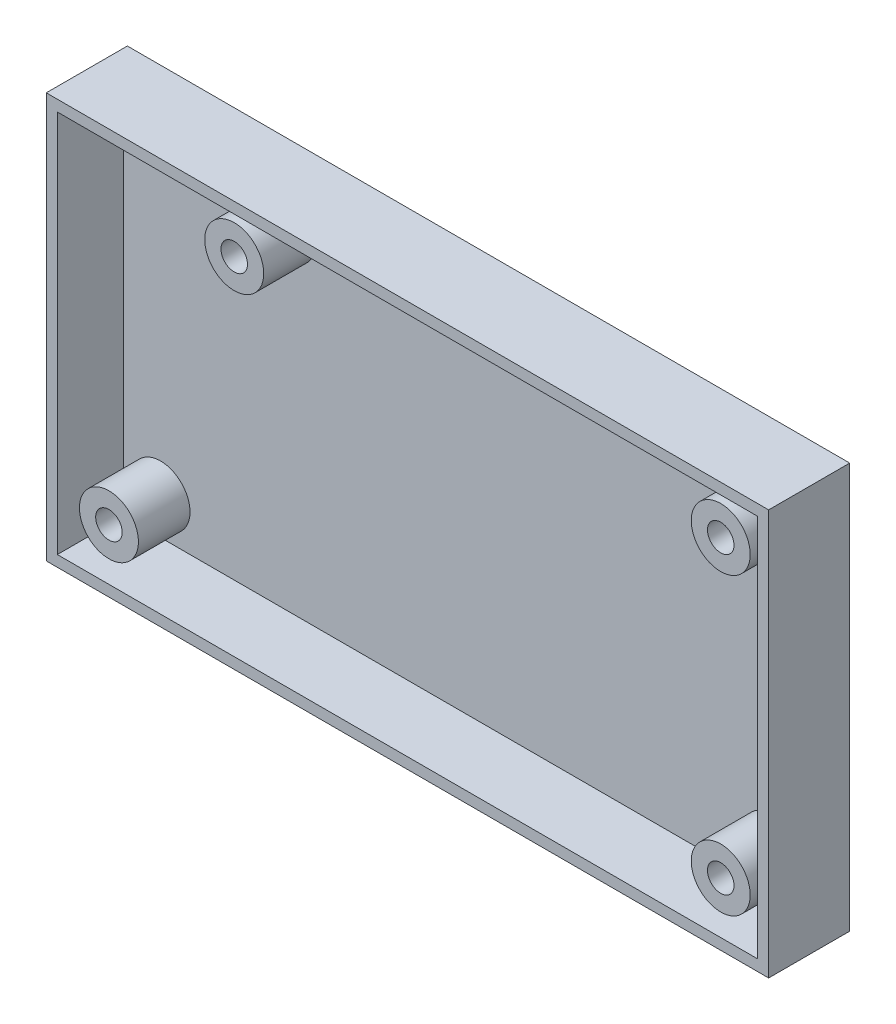
ISO-10303-21;
HEADER;
FILE_DESCRIPTION(('STEP AP214'),'2;1');
FILE_NAME('part.step','',(''),(''),'','','');
FILE_SCHEMA(('AUTOMOTIVE_DESIGN { 1 0 10303 214 1 1 1 1 }'));
ENDSEC;
DATA;
#1=APPLICATION_CONTEXT('core data for automotive mechanical design processes');
#2=APPLICATION_PROTOCOL_DEFINITION('international standard','automotive_design',2000,#1);
#3=PRODUCT_CONTEXT('',#1,'mechanical');
#4=PRODUCT('Part','Part','',(#3));
#5=PRODUCT_RELATED_PRODUCT_CATEGORY('part','',(#4));
#6=PRODUCT_DEFINITION_FORMATION('','',#4);
#7=PRODUCT_DEFINITION_CONTEXT('part definition',#1,'design');
#8=PRODUCT_DEFINITION('design','',#6,#7);
#9=PRODUCT_DEFINITION_SHAPE('','',#8);
#10=(LENGTH_UNIT() NAMED_UNIT(*) SI_UNIT(.MILLI.,.METRE.));
#11=(NAMED_UNIT(*) PLANE_ANGLE_UNIT() SI_UNIT($,.RADIAN.));
#12=(NAMED_UNIT(*) SI_UNIT($,.STERADIAN.) SOLID_ANGLE_UNIT());
#13=UNCERTAINTY_MEASURE_WITH_UNIT(LENGTH_MEASURE(1.E-05),#10,'distance_accuracy_value','');
#14=(GEOMETRIC_REPRESENTATION_CONTEXT(3) GLOBAL_UNCERTAINTY_ASSIGNED_CONTEXT((#13)) GLOBAL_UNIT_ASSIGNED_CONTEXT((#10,
#11,#12)) REPRESENTATION_CONTEXT('',''));
#15=CARTESIAN_POINT('',(0.,0.,0.));
#16=DIRECTION('',(0.,0.,1.));
#17=DIRECTION('',(1.,0.,0.));
#18=AXIS2_PLACEMENT_3D('',#15,#16,#17);
#19=CARTESIAN_POINT('',(0.,0.,2.));
#20=DIRECTION('',(1.,0.,0.));
#21=DIRECTION('',(0.,1.,0.));
#22=AXIS2_PLACEMENT_3D('',#19,#20,#21);
#23=PLANE('',#22);
#24=DIRECTION('',(0.,-1.,0.));
#25=VECTOR('',#24,1.);
#26=CARTESIAN_POINT('',(0.,0.,0.));
#27=LINE('',#26,#25);
#28=CARTESIAN_POINT('',(0.,0.,0.));
#29=VERTEX_POINT('',#28);
#30=CARTESIAN_POINT('',(0.,-55.,0.));
#31=VERTEX_POINT('',#30);
#32=EDGE_CURVE('E173',#29,#31,#27,.T.);
#33=ORIENTED_EDGE('',*,*,#32,.T.);
#34=DIRECTION('',(0.,0.,-1.));
#35=VECTOR('',#34,1.);
#36=CARTESIAN_POINT('',(0.,-55.,2.));
#37=LINE('',#36,#35);
#38=CARTESIAN_POINT('',(0.,-55.,11.));
#39=VERTEX_POINT('',#38);
#40=EDGE_CURVE('E198',#39,#31,#37,.T.);
#41=ORIENTED_EDGE('',*,*,#40,.F.);
#42=DIRECTION('',(0.,-1.,0.));
#43=VECTOR('',#42,1.);
#44=CARTESIAN_POINT('',(0.,0.,11.));
#45=LINE('',#44,#43);
#46=CARTESIAN_POINT('',(0.,0.,11.));
#47=VERTEX_POINT('',#46);
#48=EDGE_CURVE('E169',#47,#39,#45,.T.);
#49=ORIENTED_EDGE('',*,*,#48,.F.);
#50=DIRECTION('',(0.,0.,-1.));
#51=VECTOR('',#50,1.);
#52=CARTESIAN_POINT('',(0.,0.,2.));
#53=LINE('',#52,#51);
#54=EDGE_CURVE('E186',#47,#29,#53,.T.);
#55=ORIENTED_EDGE('',*,*,#54,.T.);
#56=EDGE_LOOP('',(#33,#41,#49,#55));
#57=FACE_BOUND('',#56,.T.);
#58=ADVANCED_FACE('F43',(#57),#23,.F.);
#59=CARTESIAN_POINT('',(0.,-55.,2.));
#60=DIRECTION('',(0.,1.,0.));
#61=DIRECTION('',(0.,0.,1.));
#62=AXIS2_PLACEMENT_3D('',#59,#60,#61);
#63=PLANE('',#62);
#64=DIRECTION('',(1.,0.,0.));
#65=VECTOR('',#64,1.);
#66=CARTESIAN_POINT('',(0.,-55.,0.));
#67=LINE('',#66,#65);
#68=CARTESIAN_POINT('',(98.,-55.,0.));
#69=VERTEX_POINT('',#68);
#70=EDGE_CURVE('E177',#31,#69,#67,.T.);
#71=ORIENTED_EDGE('',*,*,#70,.T.);
#72=DIRECTION('',(0.,0.,-1.));
#73=VECTOR('',#72,1.);
#74=CARTESIAN_POINT('',(98.,-55.,2.));
#75=LINE('',#74,#73);
#76=CARTESIAN_POINT('',(98.,-55.,11.));
#77=VERTEX_POINT('',#76);
#78=EDGE_CURVE('E194',#77,#69,#75,.T.);
#79=ORIENTED_EDGE('',*,*,#78,.F.);
#80=DIRECTION('',(1.,0.,0.));
#81=VECTOR('',#80,1.);
#82=CARTESIAN_POINT('',(0.,-55.,11.));
#83=LINE('',#82,#81);
#84=EDGE_CURVE('E124',#39,#77,#83,.T.);
#85=ORIENTED_EDGE('',*,*,#84,.F.);
#86=ORIENTED_EDGE('',*,*,#40,.T.);
#87=EDGE_LOOP('',(#71,#79,#85,#86));
#88=FACE_BOUND('',#87,.T.);
#89=ADVANCED_FACE('F243',(#88),#63,.F.);
#90=CARTESIAN_POINT('',(98.,0.,2.));
#91=DIRECTION('',(-1.,0.,0.));
#92=DIRECTION('',(0.,0.,1.));
#93=AXIS2_PLACEMENT_3D('',#90,#91,#92);
#94=PLANE('',#93);
#95=DIRECTION('',(0.,1.,0.));
#96=VECTOR('',#95,1.);
#97=CARTESIAN_POINT('',(98.,0.,0.));
#98=LINE('',#97,#96);
#99=CARTESIAN_POINT('',(98.,0.,0.));
#100=VERTEX_POINT('',#99);
#101=EDGE_CURVE('E180',#69,#100,#98,.T.);
#102=ORIENTED_EDGE('',*,*,#101,.T.);
#103=DIRECTION('',(0.,0.,-1.));
#104=VECTOR('',#103,1.);
#105=CARTESIAN_POINT('',(98.,0.,2.));
#106=LINE('',#105,#104);
#107=CARTESIAN_POINT('',(98.,0.,11.));
#108=VERTEX_POINT('',#107);
#109=EDGE_CURVE('E190',#108,#100,#106,.T.);
#110=ORIENTED_EDGE('',*,*,#109,.F.);
#111=DIRECTION('',(0.,1.,0.));
#112=VECTOR('',#111,1.);
#113=CARTESIAN_POINT('',(98.,-55.,11.));
#114=LINE('',#113,#112);
#115=EDGE_CURVE('E161',#77,#108,#114,.T.);
#116=ORIENTED_EDGE('',*,*,#115,.F.);
#117=ORIENTED_EDGE('',*,*,#78,.T.);
#118=EDGE_LOOP('',(#102,#110,#116,#117));
#119=FACE_BOUND('',#118,.T.);
#120=ADVANCED_FACE('F248',(#119),#94,.F.);
#121=CARTESIAN_POINT('',(0.,0.,2.));
#122=DIRECTION('',(0.,-1.,0.));
#123=DIRECTION('',(0.,0.,-1.));
#124=AXIS2_PLACEMENT_3D('',#121,#122,#123);
#125=PLANE('',#124);
#126=DIRECTION('',(-1.,0.,0.));
#127=VECTOR('',#126,1.);
#128=CARTESIAN_POINT('',(0.,0.,0.));
#129=LINE('',#128,#127);
#130=EDGE_CURVE('E183',#100,#29,#129,.T.);
#131=ORIENTED_EDGE('',*,*,#130,.T.);
#132=ORIENTED_EDGE('',*,*,#54,.F.);
#133=DIRECTION('',(-1.,0.,0.));
#134=VECTOR('',#133,1.);
#135=CARTESIAN_POINT('',(98.,0.,11.));
#136=LINE('',#135,#134);
#137=EDGE_CURVE('E165',#108,#47,#136,.T.);
#138=ORIENTED_EDGE('',*,*,#137,.F.);
#139=ORIENTED_EDGE('',*,*,#109,.T.);
#140=EDGE_LOOP('',(#131,#132,#138,#139));
#141=FACE_BOUND('',#140,.T.);
#142=ADVANCED_FACE('F261',(#141),#125,.F.);
#143=CARTESIAN_POINT('',(0.,0.,0.));
#144=DIRECTION('',(0.,0.,1.));
#145=DIRECTION('',(1.,0.,0.));
#146=AXIS2_PLACEMENT_3D('',#143,#144,#145);
#147=PLANE('',#146);
#148=ORIENTED_EDGE('',*,*,#32,.F.);
#149=ORIENTED_EDGE('',*,*,#130,.F.);
#150=ORIENTED_EDGE('',*,*,#101,.F.);
#151=ORIENTED_EDGE('',*,*,#70,.F.);
#152=EDGE_LOOP('',(#148,#149,#150,#151));
#153=FACE_BOUND('',#152,.T.);
#154=ADVANCED_FACE('F254',(#153),#147,.F.);
#155=CARTESIAN_POINT('',(0.,0.,11.));
#156=DIRECTION('',(0.,0.,1.));
#157=DIRECTION('',(1.,0.,0.));
#158=AXIS2_PLACEMENT_3D('',#155,#156,#157);
#159=PLANE('',#158);
#160=ORIENTED_EDGE('',*,*,#84,.T.);
#161=ORIENTED_EDGE('',*,*,#115,.T.);
#162=ORIENTED_EDGE('',*,*,#137,.T.);
#163=ORIENTED_EDGE('',*,*,#48,.T.);
#164=EDGE_LOOP('',(#160,#161,#162,#163));
#165=FACE_BOUND('',#164,.T.);
#166=DIRECTION('',(0.,1.,0.));
#167=VECTOR('',#166,1.);
#168=CARTESIAN_POINT('',(96.5,-53.5,11.));
#169=LINE('',#168,#167);
#170=CARTESIAN_POINT('',(96.5,-53.5,11.));
#171=VERTEX_POINT('',#170);
#172=CARTESIAN_POINT('',(96.5,-1.5,11.));
#173=VERTEX_POINT('',#172);
#174=EDGE_CURVE('E117',#171,#173,#169,.T.);
#175=ORIENTED_EDGE('',*,*,#174,.F.);
#176=DIRECTION('',(1.,0.,0.));
#177=VECTOR('',#176,1.);
#178=CARTESIAN_POINT('',(1.50000000000001,-53.5,11.));
#179=LINE('',#178,#177);
#180=CARTESIAN_POINT('',(1.50000000000001,-53.5,11.));
#181=VERTEX_POINT('',#180);
#182=EDGE_CURVE('E107',#181,#171,#179,.T.);
#183=ORIENTED_EDGE('',*,*,#182,.F.);
#184=DIRECTION('',(0.,-1.,0.));
#185=VECTOR('',#184,1.);
#186=CARTESIAN_POINT('',(1.5,-1.50000000000002,11.));
#187=LINE('',#186,#185);
#188=CARTESIAN_POINT('',(1.5,-1.50000000000002,11.));
#189=VERTEX_POINT('',#188);
#190=EDGE_CURVE('E134',#189,#181,#187,.T.);
#191=ORIENTED_EDGE('',*,*,#190,.F.);
#192=DIRECTION('',(-1.,0.,0.));
#193=VECTOR('',#192,1.);
#194=CARTESIAN_POINT('',(96.5,-1.5,11.));
#195=LINE('',#194,#193);
#196=EDGE_CURVE('E130',#173,#189,#195,.T.);
#197=ORIENTED_EDGE('',*,*,#196,.F.);
#198=EDGE_LOOP('',(#175,#183,#191,#197));
#199=FACE_BOUND('',#198,.T.);
#200=ADVANCED_FACE('F128',(#165,#199),#159,.T.);
#201=CARTESIAN_POINT('',(1.50000000000001,-53.5,11.));
#202=DIRECTION('',(0.,1.,0.));
#203=DIRECTION('',(-1.,0.,0.));
#204=AXIS2_PLACEMENT_3D('',#201,#202,#203);
#205=PLANE('',#204);
#206=DIRECTION('',(1.,0.,0.));
#207=VECTOR('',#206,1.);
#208=CARTESIAN_POINT('',(1.50000000000001,-53.5,2.));
#209=LINE('',#208,#207);
#210=CARTESIAN_POINT('',(1.50000000000001,-53.5,2.));
#211=VERTEX_POINT('',#210);
#212=CARTESIAN_POINT('',(96.5,-53.5,2.));
#213=VERTEX_POINT('',#212);
#214=EDGE_CURVE('E58',#211,#213,#209,.T.);
#215=ORIENTED_EDGE('',*,*,#214,.F.);
#216=DIRECTION('',(0.,0.,-1.));
#217=VECTOR('',#216,1.);
#218=CARTESIAN_POINT('',(1.50000000000001,-53.5,11.));
#219=LINE('',#218,#217);
#220=EDGE_CURVE('E112',#181,#211,#219,.T.);
#221=ORIENTED_EDGE('',*,*,#220,.F.);
#222=ORIENTED_EDGE('',*,*,#182,.T.);
#223=DIRECTION('',(0.,0.,-1.));
#224=VECTOR('',#223,1.);
#225=CARTESIAN_POINT('',(96.5,-53.5,11.));
#226=LINE('',#225,#224);
#227=EDGE_CURVE('E110',#171,#213,#226,.T.);
#228=ORIENTED_EDGE('',*,*,#227,.T.);
#229=EDGE_LOOP('',(#215,#221,#222,#228));
#230=FACE_BOUND('',#229,.T.);
#231=ADVANCED_FACE('F109',(#230),#205,.T.);
#232=CARTESIAN_POINT('',(96.5,-53.5,11.));
#233=DIRECTION('',(-1.,0.,0.));
#234=DIRECTION('',(0.,0.,1.));
#235=AXIS2_PLACEMENT_3D('',#232,#233,#234);
#236=PLANE('',#235);
#237=DIRECTION('',(0.,1.,0.));
#238=VECTOR('',#237,1.);
#239=CARTESIAN_POINT('',(96.5,-53.5,2.));
#240=LINE('',#239,#238);
#241=CARTESIAN_POINT('',(96.5,-1.5,2.));
#242=VERTEX_POINT('',#241);
#243=EDGE_CURVE('E62',#213,#242,#240,.T.);
#244=ORIENTED_EDGE('',*,*,#243,.F.);
#245=ORIENTED_EDGE('',*,*,#227,.F.);
#246=ORIENTED_EDGE('',*,*,#174,.T.);
#247=DIRECTION('',(0.,0.,-1.));
#248=VECTOR('',#247,1.);
#249=CARTESIAN_POINT('',(96.5,-1.5,11.));
#250=LINE('',#249,#248);
#251=EDGE_CURVE('E125',#173,#242,#250,.T.);
#252=ORIENTED_EDGE('',*,*,#251,.T.);
#253=EDGE_LOOP('',(#244,#245,#246,#252));
#254=FACE_BOUND('',#253,.T.);
#255=ADVANCED_FACE('F121',(#254),#236,.T.);
#256=CARTESIAN_POINT('',(96.5,-1.5,11.));
#257=DIRECTION('',(0.,-1.,0.));
#258=DIRECTION('',(1.,0.,0.));
#259=AXIS2_PLACEMENT_3D('',#256,#257,#258);
#260=PLANE('',#259);
#261=DIRECTION('',(-1.,0.,0.));
#262=VECTOR('',#261,1.);
#263=CARTESIAN_POINT('',(96.5,-1.5,2.));
#264=LINE('',#263,#262);
#265=CARTESIAN_POINT('',(1.5,-1.50000000000002,2.));
#266=VERTEX_POINT('',#265);
#267=EDGE_CURVE('E145',#242,#266,#264,.T.);
#268=ORIENTED_EDGE('',*,*,#267,.F.);
#269=ORIENTED_EDGE('',*,*,#251,.F.);
#270=ORIENTED_EDGE('',*,*,#196,.T.);
#271=DIRECTION('',(0.,0.,-1.));
#272=VECTOR('',#271,1.);
#273=CARTESIAN_POINT('',(1.5,-1.50000000000002,11.));
#274=LINE('',#273,#272);
#275=EDGE_CURVE('E152',#189,#266,#274,.T.);
#276=ORIENTED_EDGE('',*,*,#275,.T.);
#277=EDGE_LOOP('',(#268,#269,#270,#276));
#278=FACE_BOUND('',#277,.T.);
#279=ADVANCED_FACE('F280',(#278),#260,.T.);
#280=CARTESIAN_POINT('',(1.5,-1.50000000000002,11.));
#281=DIRECTION('',(1.,0.,0.));
#282=DIRECTION('',(0.,1.,0.));
#283=AXIS2_PLACEMENT_3D('',#280,#281,#282);
#284=PLANE('',#283);
#285=DIRECTION('',(0.,-1.,0.));
#286=VECTOR('',#285,1.);
#287=CARTESIAN_POINT('',(1.5,-1.50000000000002,2.));
#288=LINE('',#287,#286);
#289=EDGE_CURVE('E118',#266,#211,#288,.T.);
#290=ORIENTED_EDGE('',*,*,#289,.F.);
#291=ORIENTED_EDGE('',*,*,#275,.F.);
#292=ORIENTED_EDGE('',*,*,#190,.T.);
#293=ORIENTED_EDGE('',*,*,#220,.T.);
#294=EDGE_LOOP('',(#290,#291,#292,#293));
#295=FACE_BOUND('',#294,.T.);
#296=ADVANCED_FACE('F283',(#295),#284,.T.);
#297=CARTESIAN_POINT('',(0.,0.,2.));
#298=DIRECTION('',(0.,0.,1.));
#299=DIRECTION('',(1.,0.,0.));
#300=AXIS2_PLACEMENT_3D('',#297,#298,#299);
#301=PLANE('',#300);
#302=CARTESIAN_POINT('',(23.5,-8.5,2.));
#303=DIRECTION('',(0.,0.,1.));
#304=DIRECTION('',(1.,0.,0.));
#305=AXIS2_PLACEMENT_3D('',#302,#303,#304);
#306=CIRCLE('',#305,4.);
#307=CARTESIAN_POINT('',(27.5,-8.5,2.));
#308=VERTEX_POINT('',#307);
#309=EDGE_CURVE('E330',#308,#308,#306,.T.);
#310=ORIENTED_EDGE('',*,*,#309,.F.);
#311=EDGE_LOOP('',(#310));
#312=FACE_BOUND('',#311,.T.);
#313=CARTESIAN_POINT('',(89.5,-8.5,2.));
#314=DIRECTION('',(0.,0.,1.));
#315=DIRECTION('',(1.,0.,0.));
#316=AXIS2_PLACEMENT_3D('',#313,#314,#315);
#317=CIRCLE('',#316,4.00000000000001);
#318=CARTESIAN_POINT('',(93.5,-8.5,2.));
#319=VERTEX_POINT('',#318);
#320=EDGE_CURVE('E342',#319,#319,#317,.T.);
#321=ORIENTED_EDGE('',*,*,#320,.F.);
#322=EDGE_LOOP('',(#321));
#323=FACE_BOUND('',#322,.T.);
#324=CARTESIAN_POINT('',(89.5,-48.5,2.));
#325=DIRECTION('',(0.,0.,1.));
#326=DIRECTION('',(1.,0.,0.));
#327=AXIS2_PLACEMENT_3D('',#324,#325,#326);
#328=CIRCLE('',#327,4.00000000000001);
#329=CARTESIAN_POINT('',(93.5,-48.5,2.));
#330=VERTEX_POINT('',#329);
#331=EDGE_CURVE('E354',#330,#330,#328,.T.);
#332=ORIENTED_EDGE('',*,*,#331,.F.);
#333=EDGE_LOOP('',(#332));
#334=FACE_BOUND('',#333,.T.);
#335=CARTESIAN_POINT('',(6.5,-48.5,2.));
#336=DIRECTION('',(0.,0.,1.));
#337=DIRECTION('',(1.,0.,0.));
#338=AXIS2_PLACEMENT_3D('',#335,#336,#337);
#339=CIRCLE('',#338,4.);
#340=CARTESIAN_POINT('',(10.5,-48.5,2.));
#341=VERTEX_POINT('',#340);
#342=EDGE_CURVE('E369',#341,#341,#339,.T.);
#343=ORIENTED_EDGE('',*,*,#342,.F.);
#344=EDGE_LOOP('',(#343));
#345=FACE_BOUND('',#344,.T.);
#346=ORIENTED_EDGE('',*,*,#214,.T.);
#347=ORIENTED_EDGE('',*,*,#243,.T.);
#348=ORIENTED_EDGE('',*,*,#267,.T.);
#349=ORIENTED_EDGE('',*,*,#289,.T.);
#350=EDGE_LOOP('',(#346,#347,#348,#349));
#351=FACE_BOUND('',#350,.T.);
#352=ADVANCED_FACE('F231',(#312,#323,#334,#345,#351),#301,.T.);
#353=CARTESIAN_POINT('',(6.5,-48.5,9.));
#354=DIRECTION('',(0.,0.,1.));
#355=DIRECTION('',(1.,0.,0.));
#356=AXIS2_PLACEMENT_3D('',#353,#354,#355);
#357=PLANE('',#356);
#358=CARTESIAN_POINT('',(6.5,-48.5,9.));
#359=DIRECTION('',(0.,0.,1.));
#360=DIRECTION('',(1.,0.,0.));
#361=AXIS2_PLACEMENT_3D('',#358,#359,#360);
#362=CIRCLE('',#361,4.);
#363=CARTESIAN_POINT('',(10.5,-48.5,9.));
#364=VERTEX_POINT('',#363);
#365=EDGE_CURVE('E142',#364,#364,#362,.T.);
#366=ORIENTED_EDGE('',*,*,#365,.T.);
#367=EDGE_LOOP('',(#366));
#368=FACE_BOUND('',#367,.T.);
#369=CARTESIAN_POINT('',(6.5,-48.5,9.));
#370=DIRECTION('',(0.,0.,1.));
#371=DIRECTION('',(1.,0.,0.));
#372=AXIS2_PLACEMENT_3D('',#369,#370,#371);
#373=CIRCLE('',#372,1.8);
#374=CARTESIAN_POINT('',(8.3,-48.5,9.));
#375=VERTEX_POINT('',#374);
#376=EDGE_CURVE('E365',#375,#375,#373,.T.);
#377=ORIENTED_EDGE('',*,*,#376,.F.);
#378=EDGE_LOOP('',(#377));
#379=FACE_BOUND('',#378,.T.);
#380=ADVANCED_FACE('F292',(#368,#379),#357,.T.);
#381=CARTESIAN_POINT('',(6.5,-48.5,9.));
#382=DIRECTION('',(0.,0.,-1.));
#383=DIRECTION('',(-1.,0.,0.));
#384=AXIS2_PLACEMENT_3D('',#381,#382,#383);
#385=CYLINDRICAL_SURFACE('',#384,4.);
#386=ORIENTED_EDGE('',*,*,#365,.F.);
#387=EDGE_LOOP('',(#386));
#388=FACE_BOUND('',#387,.T.);
#389=ORIENTED_EDGE('',*,*,#342,.T.);
#390=EDGE_LOOP('',(#389));
#391=FACE_BOUND('',#390,.T.);
#392=ADVANCED_FACE('F288',(#388,#391),#385,.T.);
#393=CARTESIAN_POINT('',(6.5,-48.5,9.));
#394=DIRECTION('',(0.,0.,-1.));
#395=DIRECTION('',(-1.,0.,0.));
#396=AXIS2_PLACEMENT_3D('',#393,#394,#395);
#397=CYLINDRICAL_SURFACE('',#396,1.8);
#398=ORIENTED_EDGE('',*,*,#376,.T.);
#399=EDGE_LOOP('',(#398));
#400=FACE_BOUND('',#399,.T.);
#401=CARTESIAN_POINT('',(6.5,-48.5,2.));
#402=DIRECTION('',(0.,0.,1.));
#403=DIRECTION('',(1.,0.,0.));
#404=AXIS2_PLACEMENT_3D('',#401,#402,#403);
#405=CIRCLE('',#404,1.8);
#406=CARTESIAN_POINT('',(8.3,-48.5,2.));
#407=VERTEX_POINT('',#406);
#408=EDGE_CURVE('E202',#407,#407,#405,.F.);
#409=ORIENTED_EDGE('',*,*,#408,.T.);
#410=EDGE_LOOP('',(#409));
#411=FACE_BOUND('',#410,.T.);
#412=ADVANCED_FACE('F291',(#400,#411),#397,.F.);
#413=ORIENTED_EDGE('',*,*,#408,.F.);
#414=EDGE_LOOP('',(#413));
#415=FACE_BOUND('',#414,.T.);
#416=ADVANCED_FACE('F238',(#415),#301,.T.);
#417=CARTESIAN_POINT('',(89.5,-48.5,9.));
#418=DIRECTION('',(0.,0.,1.));
#419=DIRECTION('',(1.,0.,0.));
#420=AXIS2_PLACEMENT_3D('',#417,#418,#419);
#421=PLANE('',#420);
#422=CARTESIAN_POINT('',(89.5,-48.5,9.));
#423=DIRECTION('',(0.,0.,1.));
#424=DIRECTION('',(1.,0.,0.));
#425=AXIS2_PLACEMENT_3D('',#422,#423,#424);
#426=CIRCLE('',#425,4.00000000000001);
#427=CARTESIAN_POINT('',(93.5,-48.5,9.));
#428=VERTEX_POINT('',#427);
#429=EDGE_CURVE('E353',#428,#428,#426,.T.);
#430=ORIENTED_EDGE('',*,*,#429,.T.);
#431=EDGE_LOOP('',(#430));
#432=FACE_BOUND('',#431,.T.);
#433=CARTESIAN_POINT('',(89.5,-48.5,9.));
#434=DIRECTION('',(0.,0.,1.));
#435=DIRECTION('',(1.,0.,0.));
#436=AXIS2_PLACEMENT_3D('',#433,#434,#435);
#437=CIRCLE('',#436,1.79999999999999);
#438=CARTESIAN_POINT('',(91.3,-48.5,9.));
#439=VERTEX_POINT('',#438);
#440=EDGE_CURVE('E358',#439,#439,#437,.T.);
#441=ORIENTED_EDGE('',*,*,#440,.F.);
#442=EDGE_LOOP('',(#441));
#443=FACE_BOUND('',#442,.T.);
#444=ADVANCED_FACE('F304',(#432,#443),#421,.T.);
#445=CARTESIAN_POINT('',(89.5,-48.5,9.));
#446=DIRECTION('',(0.,0.,-1.));
#447=DIRECTION('',(-1.,0.,0.));
#448=AXIS2_PLACEMENT_3D('',#445,#446,#447);
#449=CYLINDRICAL_SURFACE('',#448,4.00000000000001);
#450=ORIENTED_EDGE('',*,*,#429,.F.);
#451=EDGE_LOOP('',(#450));
#452=FACE_BOUND('',#451,.T.);
#453=ORIENTED_EDGE('',*,*,#331,.T.);
#454=EDGE_LOOP('',(#453));
#455=FACE_BOUND('',#454,.T.);
#456=ADVANCED_FACE('F302',(#452,#455),#449,.T.);
#457=CARTESIAN_POINT('',(89.5,-48.5,9.));
#458=DIRECTION('',(0.,0.,-1.));
#459=DIRECTION('',(-1.,0.,0.));
#460=AXIS2_PLACEMENT_3D('',#457,#458,#459);
#461=CYLINDRICAL_SURFACE('',#460,1.79999999999999);
#462=ORIENTED_EDGE('',*,*,#440,.T.);
#463=EDGE_LOOP('',(#462));
#464=FACE_BOUND('',#463,.T.);
#465=CARTESIAN_POINT('',(89.5,-48.5,2.));
#466=DIRECTION('',(0.,0.,1.));
#467=DIRECTION('',(1.,0.,0.));
#468=AXIS2_PLACEMENT_3D('',#465,#466,#467);
#469=CIRCLE('',#468,1.79999999999999);
#470=CARTESIAN_POINT('',(91.3,-48.5,2.));
#471=VERTEX_POINT('',#470);
#472=EDGE_CURVE('E206',#471,#471,#469,.F.);
#473=ORIENTED_EDGE('',*,*,#472,.T.);
#474=EDGE_LOOP('',(#473));
#475=FACE_BOUND('',#474,.T.);
#476=ADVANCED_FACE('F236',(#464,#475),#461,.F.);
#477=ORIENTED_EDGE('',*,*,#472,.F.);
#478=EDGE_LOOP('',(#477));
#479=FACE_BOUND('',#478,.T.);
#480=ADVANCED_FACE('F219',(#479),#301,.T.);
#481=CARTESIAN_POINT('',(89.5,-8.5,9.));
#482=DIRECTION('',(0.,0.,1.));
#483=DIRECTION('',(1.,0.,0.));
#484=AXIS2_PLACEMENT_3D('',#481,#482,#483);
#485=PLANE('',#484);
#486=CARTESIAN_POINT('',(89.5,-8.5,9.));
#487=DIRECTION('',(0.,0.,1.));
#488=DIRECTION('',(1.,0.,0.));
#489=AXIS2_PLACEMENT_3D('',#486,#487,#488);
#490=CIRCLE('',#489,4.00000000000001);
#491=CARTESIAN_POINT('',(93.5,-8.5,9.));
#492=VERTEX_POINT('',#491);
#493=EDGE_CURVE('E338',#492,#492,#490,.T.);
#494=ORIENTED_EDGE('',*,*,#493,.T.);
#495=EDGE_LOOP('',(#494));
#496=FACE_BOUND('',#495,.T.);
#497=CARTESIAN_POINT('',(89.5,-8.5,9.));
#498=DIRECTION('',(0.,0.,1.));
#499=DIRECTION('',(1.,0.,0.));
#500=AXIS2_PLACEMENT_3D('',#497,#498,#499);
#501=CIRCLE('',#500,1.79999999999999);
#502=CARTESIAN_POINT('',(91.3,-8.5,9.));
#503=VERTEX_POINT('',#502);
#504=EDGE_CURVE('E346',#503,#503,#501,.T.);
#505=ORIENTED_EDGE('',*,*,#504,.F.);
#506=EDGE_LOOP('',(#505));
#507=FACE_BOUND('',#506,.T.);
#508=ADVANCED_FACE('F235',(#496,#507),#485,.T.);
#509=CARTESIAN_POINT('',(89.5,-8.5,9.));
#510=DIRECTION('',(0.,0.,-1.));
#511=DIRECTION('',(-1.,0.,0.));
#512=AXIS2_PLACEMENT_3D('',#509,#510,#511);
#513=CYLINDRICAL_SURFACE('',#512,4.00000000000001);
#514=ORIENTED_EDGE('',*,*,#493,.F.);
#515=EDGE_LOOP('',(#514));
#516=FACE_BOUND('',#515,.T.);
#517=ORIENTED_EDGE('',*,*,#320,.T.);
#518=EDGE_LOOP('',(#517));
#519=FACE_BOUND('',#518,.T.);
#520=ADVANCED_FACE('F228',(#516,#519),#513,.T.);
#521=CARTESIAN_POINT('',(89.5,-8.5,9.));
#522=DIRECTION('',(0.,0.,-1.));
#523=DIRECTION('',(-1.,0.,0.));
#524=AXIS2_PLACEMENT_3D('',#521,#522,#523);
#525=CYLINDRICAL_SURFACE('',#524,1.79999999999999);
#526=ORIENTED_EDGE('',*,*,#504,.T.);
#527=EDGE_LOOP('',(#526));
#528=FACE_BOUND('',#527,.T.);
#529=CARTESIAN_POINT('',(89.5,-8.5,2.));
#530=DIRECTION('',(0.,0.,1.));
#531=DIRECTION('',(1.,0.,0.));
#532=AXIS2_PLACEMENT_3D('',#529,#530,#531);
#533=CIRCLE('',#532,1.79999999999999);
#534=CARTESIAN_POINT('',(91.3,-8.5,2.));
#535=VERTEX_POINT('',#534);
#536=EDGE_CURVE('E51',#535,#535,#533,.F.);
#537=ORIENTED_EDGE('',*,*,#536,.T.);
#538=EDGE_LOOP('',(#537));
#539=FACE_BOUND('',#538,.T.);
#540=ADVANCED_FACE('F213',(#528,#539),#525,.F.);
#541=ORIENTED_EDGE('',*,*,#536,.F.);
#542=EDGE_LOOP('',(#541));
#543=FACE_BOUND('',#542,.T.);
#544=ADVANCED_FACE('F215',(#543),#301,.T.);
#545=CARTESIAN_POINT('',(23.5,-8.5,9.));
#546=DIRECTION('',(0.,0.,1.));
#547=DIRECTION('',(1.,0.,0.));
#548=AXIS2_PLACEMENT_3D('',#545,#546,#547);
#549=PLANE('',#548);
#550=CARTESIAN_POINT('',(23.5,-8.5,9.));
#551=DIRECTION('',(0.,0.,1.));
#552=DIRECTION('',(1.,0.,0.));
#553=AXIS2_PLACEMENT_3D('',#550,#551,#552);
#554=CIRCLE('',#553,4.);
#555=CARTESIAN_POINT('',(27.5,-8.5,9.));
#556=VERTEX_POINT('',#555);
#557=EDGE_CURVE('E327',#556,#556,#554,.T.);
#558=ORIENTED_EDGE('',*,*,#557,.T.);
#559=EDGE_LOOP('',(#558));
#560=FACE_BOUND('',#559,.T.);
#561=CARTESIAN_POINT('',(23.5,-8.5,9.));
#562=DIRECTION('',(0.,0.,1.));
#563=DIRECTION('',(1.,0.,0.));
#564=AXIS2_PLACEMENT_3D('',#561,#562,#563);
#565=CIRCLE('',#564,1.8);
#566=CARTESIAN_POINT('',(25.3,-8.5,9.));
#567=VERTEX_POINT('',#566);
#568=EDGE_CURVE('E333',#567,#567,#565,.T.);
#569=ORIENTED_EDGE('',*,*,#568,.F.);
#570=EDGE_LOOP('',(#569));
#571=FACE_BOUND('',#570,.T.);
#572=ADVANCED_FACE('F217',(#560,#571),#549,.T.);
#573=CARTESIAN_POINT('',(23.5,-8.5,9.));
#574=DIRECTION('',(0.,0.,-1.));
#575=DIRECTION('',(-1.,0.,0.));
#576=AXIS2_PLACEMENT_3D('',#573,#574,#575);
#577=CYLINDRICAL_SURFACE('',#576,4.);
#578=ORIENTED_EDGE('',*,*,#557,.F.);
#579=EDGE_LOOP('',(#578));
#580=FACE_BOUND('',#579,.T.);
#581=ORIENTED_EDGE('',*,*,#309,.T.);
#582=EDGE_LOOP('',(#581));
#583=FACE_BOUND('',#582,.T.);
#584=ADVANCED_FACE('F225',(#580,#583),#577,.T.);
#585=CARTESIAN_POINT('',(23.5,-8.5,9.));
#586=DIRECTION('',(0.,0.,-1.));
#587=DIRECTION('',(-1.,0.,0.));
#588=AXIS2_PLACEMENT_3D('',#585,#586,#587);
#589=CYLINDRICAL_SURFACE('',#588,1.8);
#590=ORIENTED_EDGE('',*,*,#568,.T.);
#591=EDGE_LOOP('',(#590));
#592=FACE_BOUND('',#591,.T.);
#593=CARTESIAN_POINT('',(23.5,-8.5,2.));
#594=DIRECTION('',(0.,0.,1.));
#595=DIRECTION('',(1.,0.,0.));
#596=AXIS2_PLACEMENT_3D('',#593,#594,#595);
#597=CIRCLE('',#596,1.8);
#598=CARTESIAN_POINT('',(25.3,-8.5,2.));
#599=VERTEX_POINT('',#598);
#600=EDGE_CURVE('E11',#599,#599,#597,.F.);
#601=ORIENTED_EDGE('',*,*,#600,.T.);
#602=EDGE_LOOP('',(#601));
#603=FACE_BOUND('',#602,.T.);
#604=ADVANCED_FACE('F240',(#592,#603),#589,.F.);
#605=ORIENTED_EDGE('',*,*,#600,.F.);
#606=EDGE_LOOP('',(#605));
#607=FACE_BOUND('',#606,.T.);
#608=ADVANCED_FACE('F220',(#607),#301,.T.);
#609=CLOSED_SHELL('',(#58,#89,#120,#142,#154,#200,#231,#255,#279,#296,#352,#380,#392,#412,#416,
#444,#456,#476,#480,#508,#520,#540,#544,#572,#584,#604,#608));
#610=MANIFOLD_SOLID_BREP('B2',#609);
#611=ADVANCED_BREP_SHAPE_REPRESENTATION('',(#18,#610),#14);
#612=SHAPE_DEFINITION_REPRESENTATION(#9,#611);
ENDSEC;
END-ISO-10303-21;
